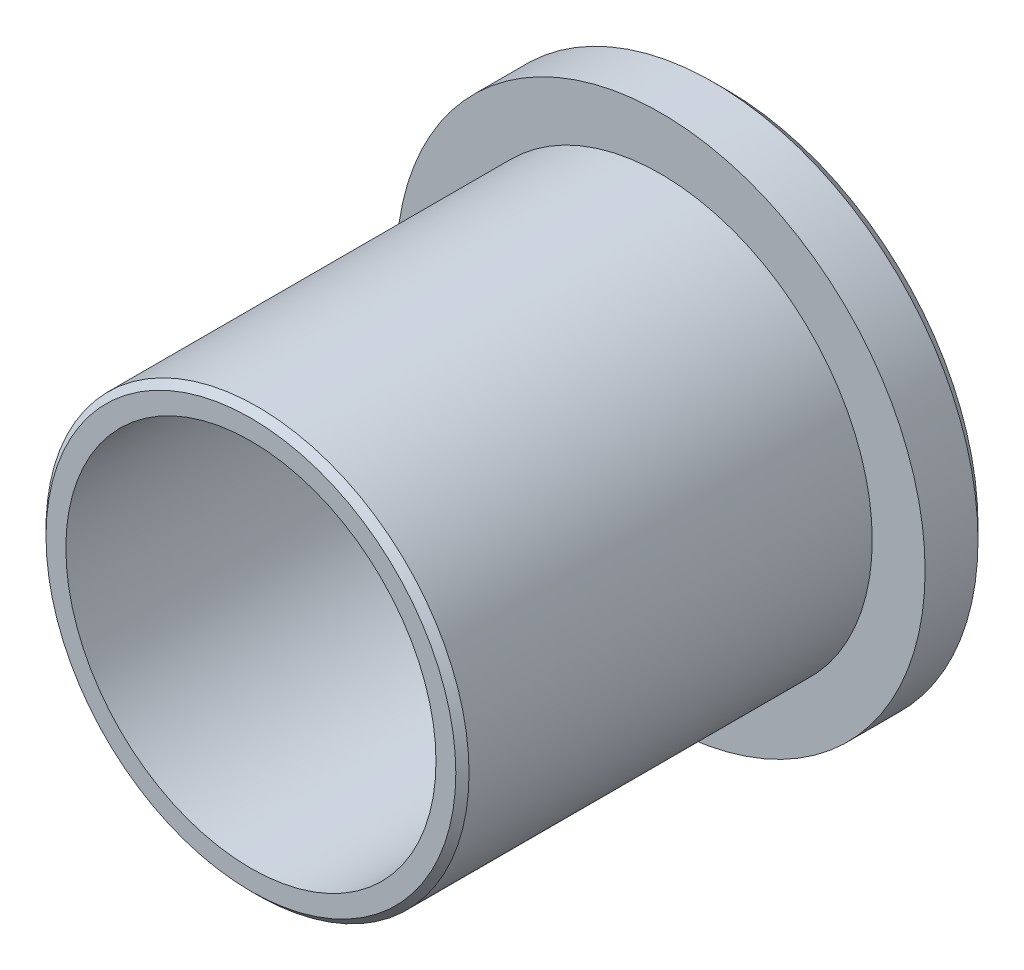
ISO-10303-21;
HEADER;
FILE_DESCRIPTION(('STEP AP214'),'2;1');
FILE_NAME('part.step','',(''),(''),'','','');
FILE_SCHEMA(('AUTOMOTIVE_DESIGN { 1 0 10303 214 1 1 1 1 }'));
ENDSEC;
DATA;
#1=APPLICATION_CONTEXT('core data for automotive mechanical design processes');
#2=APPLICATION_PROTOCOL_DEFINITION('international standard','automotive_design',2000,#1);
#3=PRODUCT_CONTEXT('',#1,'mechanical');
#4=PRODUCT('Part','Part','',(#3));
#5=PRODUCT_RELATED_PRODUCT_CATEGORY('part','',(#4));
#6=PRODUCT_DEFINITION_FORMATION('','',#4);
#7=PRODUCT_DEFINITION_CONTEXT('part definition',#1,'design');
#8=PRODUCT_DEFINITION('design','',#6,#7);
#9=PRODUCT_DEFINITION_SHAPE('','',#8);
#10=(LENGTH_UNIT() NAMED_UNIT(*) SI_UNIT(.MILLI.,.METRE.));
#11=(NAMED_UNIT(*) PLANE_ANGLE_UNIT() SI_UNIT($,.RADIAN.));
#12=(NAMED_UNIT(*) SI_UNIT($,.STERADIAN.) SOLID_ANGLE_UNIT());
#13=UNCERTAINTY_MEASURE_WITH_UNIT(LENGTH_MEASURE(1.E-05),#10,'distance_accuracy_value','');
#14=(GEOMETRIC_REPRESENTATION_CONTEXT(3) GLOBAL_UNCERTAINTY_ASSIGNED_CONTEXT((#13)) GLOBAL_UNIT_ASSIGNED_CONTEXT((#10,
#11,#12)) REPRESENTATION_CONTEXT('',''));
#15=CARTESIAN_POINT('',(0.,0.,0.));
#16=DIRECTION('',(0.,0.,1.));
#17=DIRECTION('',(1.,0.,0.));
#18=AXIS2_PLACEMENT_3D('',#15,#16,#17);
#19=CARTESIAN_POINT('',(0.,7.75,0.));
#20=DIRECTION('',(0.,0.,-1.));
#21=DIRECTION('',(-1.,0.,0.));
#22=AXIS2_PLACEMENT_3D('',#19,#20,#21);
#23=PLANE('',#22);
#24=CARTESIAN_POINT('',(0.,0.,0.));
#25=DIRECTION('',(0.,0.,1.));
#26=DIRECTION('',(1.,0.,0.));
#27=AXIS2_PLACEMENT_3D('',#24,#25,#26);
#28=CIRCLE('',#27,7.);
#29=CARTESIAN_POINT('',(7.,0.,0.));
#30=VERTEX_POINT('',#29);
#31=EDGE_CURVE('E10',#30,#30,#28,.T.);
#32=ORIENTED_EDGE('',*,*,#31,.F.);
#33=EDGE_LOOP('',(#32));
#34=FACE_BOUND('',#33,.T.);
#35=CARTESIAN_POINT('',(0.,0.,0.));
#36=DIRECTION('',(0.,0.,1.));
#37=DIRECTION('',(1.,0.,0.));
#38=AXIS2_PLACEMENT_3D('',#35,#36,#37);
#39=CIRCLE('',#38,7.75);
#40=CARTESIAN_POINT('',(7.75,0.,0.));
#41=VERTEX_POINT('',#40);
#42=EDGE_CURVE('E63',#41,#41,#39,.T.);
#43=ORIENTED_EDGE('',*,*,#42,.T.);
#44=EDGE_LOOP('',(#43));
#45=FACE_BOUND('',#44,.T.);
#46=ADVANCED_FACE('F35',(#34,#45),#23,.F.);
#47=CARTESIAN_POINT('',(0.,0.,0.));
#48=DIRECTION('',(0.,0.,1.));
#49=DIRECTION('',(1.,0.,0.));
#50=AXIS2_PLACEMENT_3D('',#47,#48,#49);
#51=CYLINDRICAL_SURFACE('',#50,7.);
#52=CARTESIAN_POINT('',(0.,0.,-18.));
#53=DIRECTION('',(0.,0.,1.));
#54=DIRECTION('',(1.,0.,0.));
#55=AXIS2_PLACEMENT_3D('',#52,#53,#54);
#56=CIRCLE('',#55,7.);
#57=CARTESIAN_POINT('',(7.,0.,-18.));
#58=VERTEX_POINT('',#57);
#59=EDGE_CURVE('E41',#58,#58,#56,.T.);
#60=ORIENTED_EDGE('',*,*,#59,.F.);
#61=EDGE_LOOP('',(#60));
#62=FACE_BOUND('',#61,.T.);
#63=ORIENTED_EDGE('',*,*,#31,.T.);
#64=EDGE_LOOP('',(#63));
#65=FACE_BOUND('',#64,.T.);
#66=ADVANCED_FACE('F100',(#62,#65),#51,.F.);
#67=CARTESIAN_POINT('',(0.,7.,-18.));
#68=DIRECTION('',(0.,0.,1.));
#69=DIRECTION('',(1.,0.,0.));
#70=AXIS2_PLACEMENT_3D('',#67,#68,#69);
#71=PLANE('',#70);
#72=CARTESIAN_POINT('',(0.,0.,-18.));
#73=DIRECTION('',(0.,0.,1.));
#74=DIRECTION('',(1.,0.,0.));
#75=AXIS2_PLACEMENT_3D('',#72,#73,#74);
#76=CIRCLE('',#75,9.5);
#77=CARTESIAN_POINT('',(9.5,0.,-18.));
#78=VERTEX_POINT('',#77);
#79=EDGE_CURVE('E45',#78,#78,#76,.T.);
#80=ORIENTED_EDGE('',*,*,#79,.F.);
#81=EDGE_LOOP('',(#80));
#82=FACE_BOUND('',#81,.T.);
#83=ORIENTED_EDGE('',*,*,#59,.T.);
#84=EDGE_LOOP('',(#83));
#85=FACE_BOUND('',#84,.T.);
#86=ADVANCED_FACE('F95',(#82,#85),#71,.F.);
#87=CARTESIAN_POINT('',(0.,0.,-18.));
#88=DIRECTION('',(0.,0.,1.));
#89=DIRECTION('',(1.,0.,0.));
#90=AXIS2_PLACEMENT_3D('',#87,#88,#89);
#91=CONICAL_SURFACE('',#90,9.5,0.785398163397448);
#92=CARTESIAN_POINT('',(0.,0.,-17.5));
#93=DIRECTION('',(0.,0.,1.));
#94=DIRECTION('',(1.,0.,0.));
#95=AXIS2_PLACEMENT_3D('',#92,#93,#94);
#96=CIRCLE('',#95,10.);
#97=CARTESIAN_POINT('',(10.,0.,-17.5));
#98=VERTEX_POINT('',#97);
#99=EDGE_CURVE('E49',#98,#98,#96,.T.);
#100=ORIENTED_EDGE('',*,*,#99,.F.);
#101=EDGE_LOOP('',(#100));
#102=FACE_BOUND('',#101,.T.);
#103=ORIENTED_EDGE('',*,*,#79,.T.);
#104=EDGE_LOOP('',(#103));
#105=FACE_BOUND('',#104,.T.);
#106=ADVANCED_FACE('F89',(#102,#105),#91,.T.);
#107=CARTESIAN_POINT('',(0.,0.,0.));
#108=DIRECTION('',(0.,0.,1.));
#109=DIRECTION('',(1.,0.,0.));
#110=AXIS2_PLACEMENT_3D('',#107,#108,#109);
#111=CYLINDRICAL_SURFACE('',#110,10.);
#112=CARTESIAN_POINT('',(0.,0.,-15.5));
#113=DIRECTION('',(0.,0.,1.));
#114=DIRECTION('',(1.,0.,0.));
#115=AXIS2_PLACEMENT_3D('',#112,#113,#114);
#116=CIRCLE('',#115,10.);
#117=CARTESIAN_POINT('',(10.,0.,-15.5));
#118=VERTEX_POINT('',#117);
#119=EDGE_CURVE('E54',#118,#118,#116,.T.);
#120=ORIENTED_EDGE('',*,*,#119,.F.);
#121=EDGE_LOOP('',(#120));
#122=FACE_BOUND('',#121,.T.);
#123=ORIENTED_EDGE('',*,*,#99,.T.);
#124=EDGE_LOOP('',(#123));
#125=FACE_BOUND('',#124,.T.);
#126=ADVANCED_FACE('F83',(#122,#125),#111,.T.);
#127=CARTESIAN_POINT('',(0.,10.,-15.5));
#128=DIRECTION('',(0.,0.,-1.));
#129=DIRECTION('',(-1.,0.,0.));
#130=AXIS2_PLACEMENT_3D('',#127,#128,#129);
#131=PLANE('',#130);
#132=CARTESIAN_POINT('',(0.,0.,-15.5));
#133=DIRECTION('',(0.,0.,1.));
#134=DIRECTION('',(1.,0.,0.));
#135=AXIS2_PLACEMENT_3D('',#132,#133,#134);
#136=CIRCLE('',#135,8.);
#137=CARTESIAN_POINT('',(8.,0.,-15.5));
#138=VERTEX_POINT('',#137);
#139=EDGE_CURVE('E57',#138,#138,#136,.T.);
#140=ORIENTED_EDGE('',*,*,#139,.F.);
#141=EDGE_LOOP('',(#140));
#142=FACE_BOUND('',#141,.T.);
#143=ORIENTED_EDGE('',*,*,#119,.T.);
#144=EDGE_LOOP('',(#143));
#145=FACE_BOUND('',#144,.T.);
#146=ADVANCED_FACE('F77',(#142,#145),#131,.F.);
#147=CARTESIAN_POINT('',(0.,0.,0.));
#148=DIRECTION('',(0.,0.,1.));
#149=DIRECTION('',(1.,0.,0.));
#150=AXIS2_PLACEMENT_3D('',#147,#148,#149);
#151=CYLINDRICAL_SURFACE('',#150,8.);
#152=CARTESIAN_POINT('',(0.,0.,-0.25));
#153=DIRECTION('',(0.,0.,1.));
#154=DIRECTION('',(1.,0.,0.));
#155=AXIS2_PLACEMENT_3D('',#152,#153,#154);
#156=CIRCLE('',#155,8.);
#157=CARTESIAN_POINT('',(8.,0.,-0.25));
#158=VERTEX_POINT('',#157);
#159=EDGE_CURVE('E60',#158,#158,#156,.T.);
#160=ORIENTED_EDGE('',*,*,#159,.F.);
#161=EDGE_LOOP('',(#160));
#162=FACE_BOUND('',#161,.T.);
#163=ORIENTED_EDGE('',*,*,#139,.T.);
#164=EDGE_LOOP('',(#163));
#165=FACE_BOUND('',#164,.T.);
#166=ADVANCED_FACE('F71',(#162,#165),#151,.T.);
#167=CARTESIAN_POINT('',(0.,0.,-0.25));
#168=DIRECTION('',(0.,0.,-1.));
#169=DIRECTION('',(-1.,0.,0.));
#170=AXIS2_PLACEMENT_3D('',#167,#168,#169);
#171=CONICAL_SURFACE('',#170,8.,0.785398163397449);
#172=ORIENTED_EDGE('',*,*,#42,.F.);
#173=EDGE_LOOP('',(#172));
#174=FACE_BOUND('',#173,.T.);
#175=ORIENTED_EDGE('',*,*,#159,.T.);
#176=EDGE_LOOP('',(#175));
#177=FACE_BOUND('',#176,.T.);
#178=ADVANCED_FACE('F68',(#174,#177),#171,.T.);
#179=CLOSED_SHELL('',(#46,#66,#86,#106,#126,#146,#166,#178));
#180=MANIFOLD_SOLID_BREP('B2',#179);
#181=ADVANCED_BREP_SHAPE_REPRESENTATION('',(#18,#180),#14);
#182=SHAPE_DEFINITION_REPRESENTATION(#9,#181);
ENDSEC;
END-ISO-10303-21;
